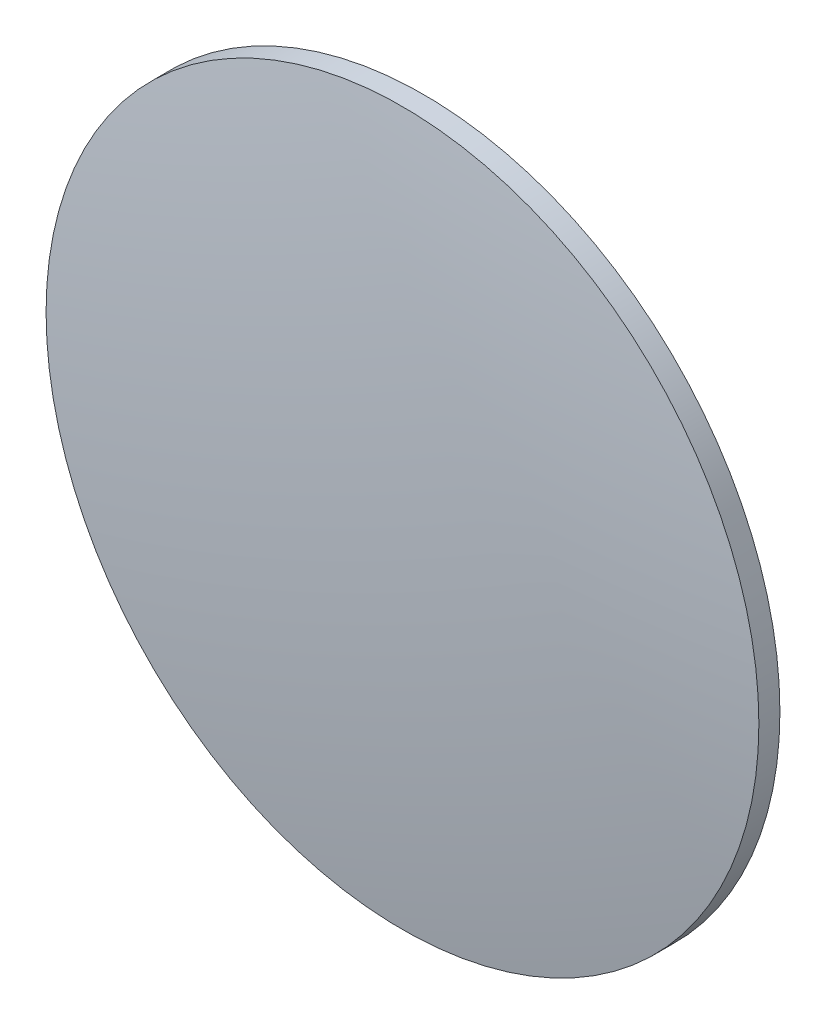
ISO-10303-21;
HEADER;
FILE_DESCRIPTION(('STEP AP214'),'2;1');
FILE_NAME('part.step','',(''),(''),'','','');
FILE_SCHEMA(('AUTOMOTIVE_DESIGN { 1 0 10303 214 1 1 1 1 }'));
ENDSEC;
DATA;
#1=APPLICATION_CONTEXT('core data for automotive mechanical design processes');
#2=APPLICATION_PROTOCOL_DEFINITION('international standard','automotive_design',2000,#1);
#3=PRODUCT_CONTEXT('',#1,'mechanical');
#4=PRODUCT('Part','Part','',(#3));
#5=PRODUCT_RELATED_PRODUCT_CATEGORY('part','',(#4));
#6=PRODUCT_DEFINITION_FORMATION('','',#4);
#7=PRODUCT_DEFINITION_CONTEXT('part definition',#1,'design');
#8=PRODUCT_DEFINITION('design','',#6,#7);
#9=PRODUCT_DEFINITION_SHAPE('','',#8);
#10=(LENGTH_UNIT() NAMED_UNIT(*) SI_UNIT(.MILLI.,.METRE.));
#11=(NAMED_UNIT(*) PLANE_ANGLE_UNIT() SI_UNIT($,.RADIAN.));
#12=(NAMED_UNIT(*) SI_UNIT($,.STERADIAN.) SOLID_ANGLE_UNIT());
#13=UNCERTAINTY_MEASURE_WITH_UNIT(LENGTH_MEASURE(1.E-05),#10,'distance_accuracy_value','');
#14=(GEOMETRIC_REPRESENTATION_CONTEXT(3) GLOBAL_UNCERTAINTY_ASSIGNED_CONTEXT((#13)) GLOBAL_UNIT_ASSIGNED_CONTEXT((#10,
#11,#12)) REPRESENTATION_CONTEXT('',''));
#15=CARTESIAN_POINT('',(0.,0.,0.));
#16=DIRECTION('',(0.,0.,1.));
#17=DIRECTION('',(1.,0.,0.));
#18=AXIS2_PLACEMENT_3D('',#15,#16,#17);
#19=CARTESIAN_POINT('',(0.,0.,-182.571));
#20=DIRECTION('',(0.,0.,1.));
#21=DIRECTION('',(1.,0.,0.));
#22=AXIS2_PLACEMENT_3D('',#19,#20,#21);
#23=CYLINDRICAL_SURFACE('',#22,25.4);
#24=CARTESIAN_POINT('',(0.,0.,179.296));
#25=DIRECTION('',(0.,0.,1.));
#26=DIRECTION('',(1.,0.,0.));
#27=AXIS2_PLACEMENT_3D('',#24,#25,#26);
#28=CIRCLE('',#27,25.4);
#29=CARTESIAN_POINT('',(25.4,0.,179.296));
#30=VERTEX_POINT('',#29);
#31=EDGE_CURVE('E39',#30,#30,#28,.T.);
#32=ORIENTED_EDGE('',*,*,#31,.T.);
#33=EDGE_LOOP('',(#32));
#34=FACE_BOUND('',#33,.T.);
#35=CARTESIAN_POINT('',(0.,0.,180.79549231383));
#36=DIRECTION('',(0.,0.,-1.));
#37=DIRECTION('',(-1.,0.,0.));
#38=AXIS2_PLACEMENT_3D('',#35,#36,#37);
#39=CIRCLE('',#38,25.4);
#40=CARTESIAN_POINT('',(-25.4,0.,180.79549231383));
#41=VERTEX_POINT('',#40);
#42=EDGE_CURVE('E10',#41,#41,#39,.F.);
#43=ORIENTED_EDGE('',*,*,#42,.F.);
#44=EDGE_LOOP('',(#43));
#45=FACE_BOUND('',#44,.T.);
#46=ADVANCED_FACE('F32',(#34,#45),#23,.T.);
#47=CARTESIAN_POINT('',(0.,0.,0.));
#48=DIRECTION('',(0.,1.,0.));
#49=DIRECTION('',(1.,0.,0.));
#50=AXIS2_PLACEMENT_3D('',#47,#48,#49);
#51=SPHERICAL_SURFACE('',#50,182.571);
#52=CARTESIAN_POINT('',(0.,0.,0.));
#53=DIRECTION('',(0.,0.,-1.));
#54=DIRECTION('',(-1.,0.,0.));
#55=AXIS2_PLACEMENT_3D('',#52,#53,#54);
#56=SPHERICAL_SURFACE('',#55,182.571);
#57=ORIENTED_EDGE('',*,*,#42,.T.);
#58=EDGE_LOOP('',(#57));
#59=FACE_BOUND('',#58,.T.);
#60=ADVANCED_FACE('F34',(#59),#56,.T.);
#61=CARTESIAN_POINT('',(0.,0.,179.296));
#62=DIRECTION('',(0.,0.,1.));
#63=DIRECTION('',(1.,0.,0.));
#64=AXIS2_PLACEMENT_3D('',#61,#62,#63);
#65=PLANE('',#64);
#66=ORIENTED_EDGE('',*,*,#31,.F.);
#67=EDGE_LOOP('',(#66));
#68=FACE_BOUND('',#67,.T.);
#69=ADVANCED_FACE('F47',(#68),#65,.F.);
#70=CLOSED_SHELL('',(#46,#60,#69));
#71=MANIFOLD_SOLID_BREP('B2',#70);
#72=ADVANCED_BREP_SHAPE_REPRESENTATION('',(#18,#71),#14);
#73=SHAPE_DEFINITION_REPRESENTATION(#9,#72);
ENDSEC;
END-ISO-10303-21;
